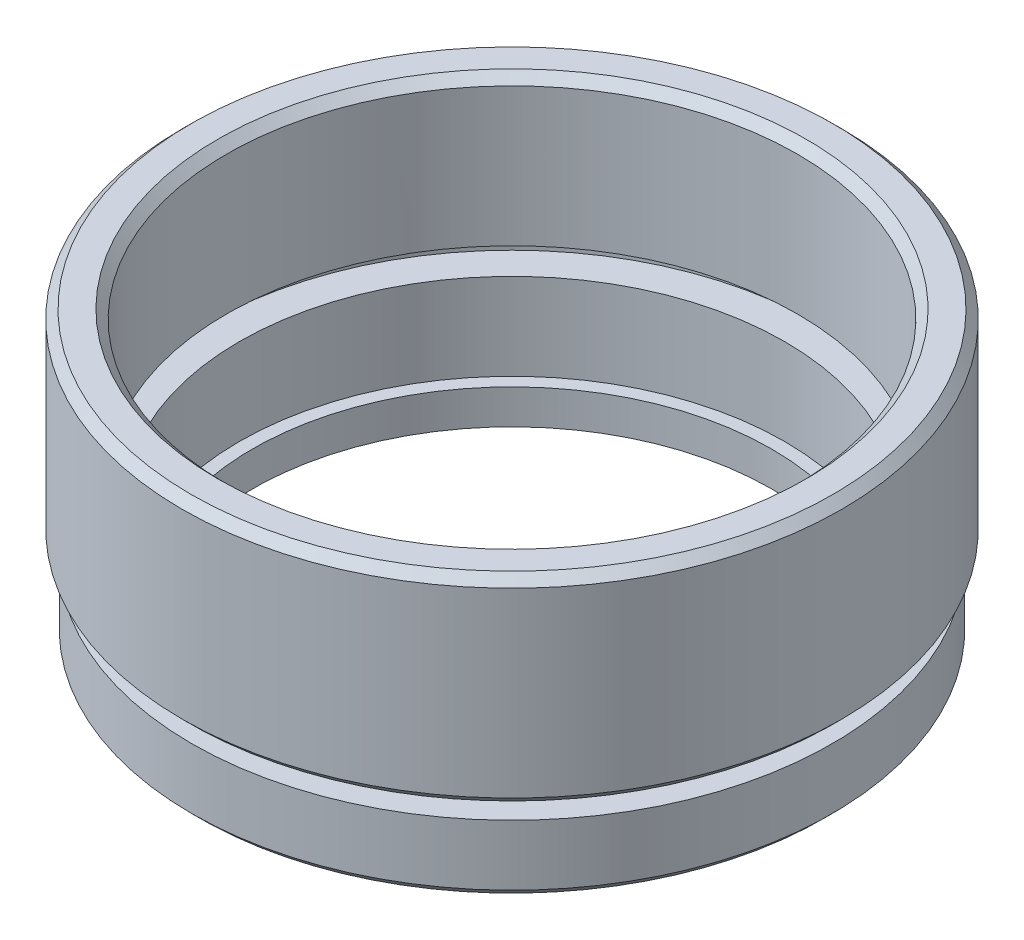
ISO-10303-21;
HEADER;
FILE_DESCRIPTION(('STEP AP214'),'2;1');
FILE_NAME('part.step','',(''),(''),'','','');
FILE_SCHEMA(('AUTOMOTIVE_DESIGN { 1 0 10303 214 1 1 1 1 }'));
ENDSEC;
DATA;
#1=APPLICATION_CONTEXT('core data for automotive mechanical design processes');
#2=APPLICATION_PROTOCOL_DEFINITION('international standard','automotive_design',2000,#1);
#3=PRODUCT_CONTEXT('',#1,'mechanical');
#4=PRODUCT('Part','Part','',(#3));
#5=PRODUCT_RELATED_PRODUCT_CATEGORY('part','',(#4));
#6=PRODUCT_DEFINITION_FORMATION('','',#4);
#7=PRODUCT_DEFINITION_CONTEXT('part definition',#1,'design');
#8=PRODUCT_DEFINITION('design','',#6,#7);
#9=PRODUCT_DEFINITION_SHAPE('','',#8);
#10=(LENGTH_UNIT() NAMED_UNIT(*) SI_UNIT(.MILLI.,.METRE.));
#11=(NAMED_UNIT(*) PLANE_ANGLE_UNIT() SI_UNIT($,.RADIAN.));
#12=(NAMED_UNIT(*) SI_UNIT($,.STERADIAN.) SOLID_ANGLE_UNIT());
#13=UNCERTAINTY_MEASURE_WITH_UNIT(LENGTH_MEASURE(1.E-05),#10,'distance_accuracy_value','');
#14=(GEOMETRIC_REPRESENTATION_CONTEXT(3) GLOBAL_UNCERTAINTY_ASSIGNED_CONTEXT((#13)) GLOBAL_UNIT_ASSIGNED_CONTEXT((#10,
#11,#12)) REPRESENTATION_CONTEXT('',''));
#15=CARTESIAN_POINT('',(0.,0.,0.));
#16=DIRECTION('',(0.,0.,1.));
#17=DIRECTION('',(1.,0.,0.));
#18=AXIS2_PLACEMENT_3D('',#15,#16,#17);
#19=CARTESIAN_POINT('',(0.,0.,0.));
#20=DIRECTION('',(0.,-1.,0.));
#21=DIRECTION('',(0.,0.,-1.));
#22=AXIS2_PLACEMENT_3D('',#19,#20,#21);
#23=CYLINDRICAL_SURFACE('',#22,15.);
#24=CARTESIAN_POINT('',(0.,0.,0.));
#25=DIRECTION('',(0.,-1.,0.));
#26=DIRECTION('',(0.,0.,-1.));
#27=AXIS2_PLACEMENT_3D('',#24,#25,#26);
#28=CIRCLE('',#27,15.);
#29=CARTESIAN_POINT('',(0.,0.,-15.));
#30=VERTEX_POINT('',#29);
#31=EDGE_CURVE('E82',#30,#30,#28,.T.);
#32=ORIENTED_EDGE('',*,*,#31,.T.);
#33=EDGE_LOOP('',(#32));
#34=FACE_BOUND('',#33,.T.);
#35=CARTESIAN_POINT('',(0.,2.,0.));
#36=DIRECTION('',(0.,-1.,0.));
#37=DIRECTION('',(0.,0.,-1.));
#38=AXIS2_PLACEMENT_3D('',#35,#36,#37);
#39=CIRCLE('',#38,15.);
#40=CARTESIAN_POINT('',(0.,2.,-15.));
#41=VERTEX_POINT('',#40);
#42=EDGE_CURVE('E115',#41,#41,#39,.T.);
#43=ORIENTED_EDGE('',*,*,#42,.F.);
#44=EDGE_LOOP('',(#43));
#45=FACE_BOUND('',#44,.T.);
#46=ADVANCED_FACE('F39',(#34,#45),#23,.F.);
#47=CARTESIAN_POINT('',(15.,0.,0.));
#48=DIRECTION('',(0.,-1.,0.));
#49=DIRECTION('',(0.,0.,-1.));
#50=AXIS2_PLACEMENT_3D('',#47,#48,#49);
#51=PLANE('',#50);
#52=CARTESIAN_POINT('',(0.,0.,0.));
#53=DIRECTION('',(0.,-1.,0.));
#54=DIRECTION('',(0.,0.,-1.));
#55=AXIS2_PLACEMENT_3D('',#52,#53,#54);
#56=CIRCLE('',#55,18.);
#57=CARTESIAN_POINT('',(0.,0.,-18.));
#58=VERTEX_POINT('',#57);
#59=EDGE_CURVE('E47',#58,#58,#56,.T.);
#60=ORIENTED_EDGE('',*,*,#59,.T.);
#61=EDGE_LOOP('',(#60));
#62=FACE_BOUND('',#61,.T.);
#63=ORIENTED_EDGE('',*,*,#31,.F.);
#64=EDGE_LOOP('',(#63));
#65=FACE_BOUND('',#64,.T.);
#66=ADVANCED_FACE('F124',(#62,#65),#51,.T.);
#67=CARTESIAN_POINT('',(0.,0.,0.));
#68=DIRECTION('',(0.,-1.,0.));
#69=DIRECTION('',(0.,0.,-1.));
#70=AXIS2_PLACEMENT_3D('',#67,#68,#69);
#71=CYLINDRICAL_SURFACE('',#70,18.5);
#72=CARTESIAN_POINT('',(0.,0.500000000000004,0.));
#73=DIRECTION('',(0.,-1.,0.));
#74=DIRECTION('',(0.,0.,-1.));
#75=AXIS2_PLACEMENT_3D('',#72,#73,#74);
#76=CIRCLE('',#75,18.5);
#77=CARTESIAN_POINT('',(0.,0.500000000000004,-18.5));
#78=VERTEX_POINT('',#77);
#79=EDGE_CURVE('E10',#78,#78,#76,.F.);
#80=ORIENTED_EDGE('',*,*,#79,.T.);
#81=EDGE_LOOP('',(#80));
#82=FACE_BOUND('',#81,.T.);
#83=CARTESIAN_POINT('',(0.,4.,0.));
#84=DIRECTION('',(0.,-1.,0.));
#85=DIRECTION('',(0.,0.,-1.));
#86=AXIS2_PLACEMENT_3D('',#83,#84,#85);
#87=CIRCLE('',#86,18.5);
#88=CARTESIAN_POINT('',(0.,4.,-18.5));
#89=VERTEX_POINT('',#88);
#90=EDGE_CURVE('E85',#89,#89,#87,.T.);
#91=ORIENTED_EDGE('',*,*,#90,.T.);
#92=EDGE_LOOP('',(#91));
#93=FACE_BOUND('',#92,.T.);
#94=ADVANCED_FACE('F130',(#82,#93),#71,.T.);
#95=CARTESIAN_POINT('',(18.5,4.,0.));
#96=DIRECTION('',(0.,1.,0.));
#97=DIRECTION('',(0.,0.,1.));
#98=AXIS2_PLACEMENT_3D('',#95,#96,#97);
#99=PLANE('',#98);
#100=CARTESIAN_POINT('',(0.,4.,0.));
#101=DIRECTION('',(0.,-1.,0.));
#102=DIRECTION('',(0.,0.,-1.));
#103=AXIS2_PLACEMENT_3D('',#100,#101,#102);
#104=CIRCLE('',#103,17.);
#105=CARTESIAN_POINT('',(0.,4.,-17.));
#106=VERTEX_POINT('',#105);
#107=EDGE_CURVE('E89',#106,#106,#104,.T.);
#108=ORIENTED_EDGE('',*,*,#107,.T.);
#109=EDGE_LOOP('',(#108));
#110=FACE_BOUND('',#109,.T.);
#111=ORIENTED_EDGE('',*,*,#90,.F.);
#112=EDGE_LOOP('',(#111));
#113=FACE_BOUND('',#112,.T.);
#114=ADVANCED_FACE('F162',(#110,#113),#99,.T.);
#115=CARTESIAN_POINT('',(0.,0.,0.));
#116=DIRECTION('',(0.,-1.,0.));
#117=DIRECTION('',(0.,0.,-1.));
#118=AXIS2_PLACEMENT_3D('',#115,#116,#117);
#119=CYLINDRICAL_SURFACE('',#118,17.);
#120=CARTESIAN_POINT('',(0.,5.,0.));
#121=DIRECTION('',(0.,-1.,0.));
#122=DIRECTION('',(0.,0.,-1.));
#123=AXIS2_PLACEMENT_3D('',#120,#121,#122);
#124=CIRCLE('',#123,17.);
#125=CARTESIAN_POINT('',(0.,5.,-17.));
#126=VERTEX_POINT('',#125);
#127=EDGE_CURVE('E93',#126,#126,#124,.T.);
#128=ORIENTED_EDGE('',*,*,#127,.T.);
#129=EDGE_LOOP('',(#128));
#130=FACE_BOUND('',#129,.T.);
#131=ORIENTED_EDGE('',*,*,#107,.F.);
#132=EDGE_LOOP('',(#131));
#133=FACE_BOUND('',#132,.T.);
#134=ADVANCED_FACE('F156',(#130,#133),#119,.T.);
#135=CARTESIAN_POINT('',(17.,5.,0.));
#136=DIRECTION('',(0.,-1.,0.));
#137=DIRECTION('',(0.,0.,-1.));
#138=AXIS2_PLACEMENT_3D('',#135,#136,#137);
#139=PLANE('',#138);
#140=CARTESIAN_POINT('',(0.,5.,0.));
#141=DIRECTION('',(0.,-1.,0.));
#142=DIRECTION('',(0.,0.,-1.));
#143=AXIS2_PLACEMENT_3D('',#140,#141,#142);
#144=CIRCLE('',#143,18.55);
#145=CARTESIAN_POINT('',(0.,5.,-18.55));
#146=VERTEX_POINT('',#145);
#147=EDGE_CURVE('E53',#146,#146,#144,.T.);
#148=ORIENTED_EDGE('',*,*,#147,.T.);
#149=EDGE_LOOP('',(#148));
#150=FACE_BOUND('',#149,.T.);
#151=ORIENTED_EDGE('',*,*,#127,.F.);
#152=EDGE_LOOP('',(#151));
#153=FACE_BOUND('',#152,.T.);
#154=ADVANCED_FACE('F152',(#150,#153),#139,.T.);
#155=CARTESIAN_POINT('',(0.,0.,0.));
#156=DIRECTION('',(0.,-1.,0.));
#157=DIRECTION('',(0.,0.,-1.));
#158=AXIS2_PLACEMENT_3D('',#155,#156,#157);
#159=CYLINDRICAL_SURFACE('',#158,19.05);
#160=CARTESIAN_POINT('',(0.,16.,0.));
#161=DIRECTION('',(0.,1.,0.));
#162=DIRECTION('',(0.,0.,1.));
#163=AXIS2_PLACEMENT_3D('',#160,#161,#162);
#164=CIRCLE('',#163,19.05);
#165=CARTESIAN_POINT('',(0.,16.,19.05));
#166=VERTEX_POINT('',#165);
#167=EDGE_CURVE('E60',#166,#166,#164,.F.);
#168=ORIENTED_EDGE('',*,*,#167,.T.);
#169=EDGE_LOOP('',(#168));
#170=FACE_BOUND('',#169,.T.);
#171=CARTESIAN_POINT('',(0.,5.50000000000001,0.));
#172=DIRECTION('',(0.,-1.,0.));
#173=DIRECTION('',(0.,0.,-1.));
#174=AXIS2_PLACEMENT_3D('',#171,#172,#173);
#175=CIRCLE('',#174,19.05);
#176=CARTESIAN_POINT('',(0.,5.50000000000001,-19.05));
#177=VERTEX_POINT('',#176);
#178=EDGE_CURVE('E66',#177,#177,#175,.F.);
#179=ORIENTED_EDGE('',*,*,#178,.T.);
#180=EDGE_LOOP('',(#179));
#181=FACE_BOUND('',#180,.T.);
#182=ADVANCED_FACE('F155',(#170,#181),#159,.T.);
#183=CARTESIAN_POINT('',(19.05,16.5,0.));
#184=DIRECTION('',(0.,1.,0.));
#185=DIRECTION('',(0.,0.,1.));
#186=AXIS2_PLACEMENT_3D('',#183,#184,#185);
#187=PLANE('',#186);
#188=CARTESIAN_POINT('',(0.,16.5,0.));
#189=DIRECTION('',(0.,1.,0.));
#190=DIRECTION('',(0.,0.,1.));
#191=AXIS2_PLACEMENT_3D('',#188,#189,#190);
#192=CIRCLE('',#191,17.);
#193=CARTESIAN_POINT('',(0.,16.5,17.));
#194=VERTEX_POINT('',#193);
#195=EDGE_CURVE('E74',#194,#194,#192,.F.);
#196=ORIENTED_EDGE('',*,*,#195,.T.);
#197=EDGE_LOOP('',(#196));
#198=FACE_BOUND('',#197,.T.);
#199=CARTESIAN_POINT('',(0.,16.5,0.));
#200=DIRECTION('',(0.,1.,0.));
#201=DIRECTION('',(0.,0.,1.));
#202=AXIS2_PLACEMENT_3D('',#199,#200,#201);
#203=CIRCLE('',#202,18.55);
#204=CARTESIAN_POINT('',(0.,16.5,18.55));
#205=VERTEX_POINT('',#204);
#206=EDGE_CURVE('E78',#205,#205,#203,.T.);
#207=ORIENTED_EDGE('',*,*,#206,.T.);
#208=EDGE_LOOP('',(#207));
#209=FACE_BOUND('',#208,.T.);
#210=ADVANCED_FACE('F177',(#198,#209),#187,.T.);
#211=CARTESIAN_POINT('',(0.,0.,0.));
#212=DIRECTION('',(0.,-1.,0.));
#213=DIRECTION('',(0.,0.,-1.));
#214=AXIS2_PLACEMENT_3D('',#211,#212,#213);
#215=CYLINDRICAL_SURFACE('',#214,16.5);
#216=CARTESIAN_POINT('',(0.,16.,0.));
#217=DIRECTION('',(0.,1.,0.));
#218=DIRECTION('',(0.,0.,1.));
#219=AXIS2_PLACEMENT_3D('',#216,#217,#218);
#220=CIRCLE('',#219,16.5);
#221=CARTESIAN_POINT('',(0.,16.,16.5));
#222=VERTEX_POINT('',#221);
#223=EDGE_CURVE('E70',#222,#222,#220,.T.);
#224=ORIENTED_EDGE('',*,*,#223,.T.);
#225=EDGE_LOOP('',(#224));
#226=FACE_BOUND('',#225,.T.);
#227=CARTESIAN_POINT('',(0.,8.,0.));
#228=DIRECTION('',(0.,-1.,0.));
#229=DIRECTION('',(0.,0.,-1.));
#230=AXIS2_PLACEMENT_3D('',#227,#228,#229);
#231=CIRCLE('',#230,16.5);
#232=CARTESIAN_POINT('',(0.,8.,-16.5));
#233=VERTEX_POINT('',#232);
#234=EDGE_CURVE('E97',#233,#233,#231,.T.);
#235=ORIENTED_EDGE('',*,*,#234,.T.);
#236=EDGE_LOOP('',(#235));
#237=FACE_BOUND('',#236,.T.);
#238=ADVANCED_FACE('F181',(#226,#237),#215,.F.);
#239=CARTESIAN_POINT('',(16.5,8.,0.));
#240=DIRECTION('',(0.,-1.,0.));
#241=DIRECTION('',(0.,0.,-1.));
#242=AXIS2_PLACEMENT_3D('',#239,#240,#241);
#243=PLANE('',#242);
#244=CARTESIAN_POINT('',(0.,8.,0.));
#245=DIRECTION('',(0.,-1.,0.));
#246=DIRECTION('',(0.,0.,-1.));
#247=AXIS2_PLACEMENT_3D('',#244,#245,#246);
#248=CIRCLE('',#247,17.6);
#249=CARTESIAN_POINT('',(0.,8.,-17.6));
#250=VERTEX_POINT('',#249);
#251=EDGE_CURVE('E101',#250,#250,#248,.T.);
#252=ORIENTED_EDGE('',*,*,#251,.T.);
#253=EDGE_LOOP('',(#252));
#254=FACE_BOUND('',#253,.T.);
#255=ORIENTED_EDGE('',*,*,#234,.F.);
#256=EDGE_LOOP('',(#255));
#257=FACE_BOUND('',#256,.T.);
#258=ADVANCED_FACE('F185',(#254,#257),#243,.T.);
#259=CARTESIAN_POINT('',(0.,0.,0.));
#260=DIRECTION('',(0.,-1.,0.));
#261=DIRECTION('',(0.,0.,-1.));
#262=AXIS2_PLACEMENT_3D('',#259,#260,#261);
#263=CYLINDRICAL_SURFACE('',#262,17.6);
#264=CARTESIAN_POINT('',(0.,7.,0.));
#265=DIRECTION('',(0.,-1.,0.));
#266=DIRECTION('',(0.,0.,-1.));
#267=AXIS2_PLACEMENT_3D('',#264,#265,#266);
#268=CIRCLE('',#267,17.6);
#269=CARTESIAN_POINT('',(0.,7.,-17.6));
#270=VERTEX_POINT('',#269);
#271=EDGE_CURVE('E104',#270,#270,#268,.T.);
#272=ORIENTED_EDGE('',*,*,#271,.T.);
#273=EDGE_LOOP('',(#272));
#274=FACE_BOUND('',#273,.T.);
#275=ORIENTED_EDGE('',*,*,#251,.F.);
#276=EDGE_LOOP('',(#275));
#277=FACE_BOUND('',#276,.T.);
#278=ADVANCED_FACE('F189',(#274,#277),#263,.F.);
#279=CARTESIAN_POINT('',(17.6,7.,0.));
#280=DIRECTION('',(0.,1.,0.));
#281=DIRECTION('',(0.,0.,1.));
#282=AXIS2_PLACEMENT_3D('',#279,#280,#281);
#283=PLANE('',#282);
#284=CARTESIAN_POINT('',(0.,7.,0.));
#285=DIRECTION('',(0.,-1.,0.));
#286=DIRECTION('',(0.,0.,-1.));
#287=AXIS2_PLACEMENT_3D('',#284,#285,#286);
#288=CIRCLE('',#287,15.75);
#289=CARTESIAN_POINT('',(0.,7.,-15.75));
#290=VERTEX_POINT('',#289);
#291=EDGE_CURVE('E108',#290,#290,#288,.T.);
#292=ORIENTED_EDGE('',*,*,#291,.T.);
#293=EDGE_LOOP('',(#292));
#294=FACE_BOUND('',#293,.T.);
#295=ORIENTED_EDGE('',*,*,#271,.F.);
#296=EDGE_LOOP('',(#295));
#297=FACE_BOUND('',#296,.T.);
#298=ADVANCED_FACE('F193',(#294,#297),#283,.T.);
#299=CARTESIAN_POINT('',(0.,0.,0.));
#300=DIRECTION('',(0.,-1.,0.));
#301=DIRECTION('',(0.,0.,-1.));
#302=AXIS2_PLACEMENT_3D('',#299,#300,#301);
#303=CYLINDRICAL_SURFACE('',#302,15.75);
#304=CARTESIAN_POINT('',(0.,2.,0.));
#305=DIRECTION('',(0.,-1.,0.));
#306=DIRECTION('',(0.,0.,-1.));
#307=AXIS2_PLACEMENT_3D('',#304,#305,#306);
#308=CIRCLE('',#307,15.75);
#309=CARTESIAN_POINT('',(0.,2.,-15.75));
#310=VERTEX_POINT('',#309);
#311=EDGE_CURVE('E111',#310,#310,#308,.T.);
#312=ORIENTED_EDGE('',*,*,#311,.T.);
#313=EDGE_LOOP('',(#312));
#314=FACE_BOUND('',#313,.T.);
#315=ORIENTED_EDGE('',*,*,#291,.F.);
#316=EDGE_LOOP('',(#315));
#317=FACE_BOUND('',#316,.T.);
#318=ADVANCED_FACE('F197',(#314,#317),#303,.F.);
#319=CARTESIAN_POINT('',(15.75,2.,0.));
#320=DIRECTION('',(0.,1.,0.));
#321=DIRECTION('',(0.,0.,1.));
#322=AXIS2_PLACEMENT_3D('',#319,#320,#321);
#323=PLANE('',#322);
#324=ORIENTED_EDGE('',*,*,#42,.T.);
#325=EDGE_LOOP('',(#324));
#326=FACE_BOUND('',#325,.T.);
#327=ORIENTED_EDGE('',*,*,#311,.F.);
#328=EDGE_LOOP('',(#327));
#329=FACE_BOUND('',#328,.T.);
#330=ADVANCED_FACE('F120',(#326,#329),#323,.T.);
#331=CARTESIAN_POINT('',(0.,16.5,0.));
#332=DIRECTION('',(0.,1.,0.));
#333=DIRECTION('',(0.,0.,1.));
#334=AXIS2_PLACEMENT_3D('',#331,#332,#333);
#335=CONICAL_SURFACE('',#334,17.,0.785398163397448);
#336=ORIENTED_EDGE('',*,*,#223,.F.);
#337=EDGE_LOOP('',(#336));
#338=FACE_BOUND('',#337,.T.);
#339=ORIENTED_EDGE('',*,*,#195,.F.);
#340=EDGE_LOOP('',(#339));
#341=FACE_BOUND('',#340,.T.);
#342=ADVANCED_FACE('F134',(#338,#341),#335,.F.);
#343=CARTESIAN_POINT('',(0.,16.,0.));
#344=DIRECTION('',(0.,-1.,0.));
#345=DIRECTION('',(0.,0.,-1.));
#346=AXIS2_PLACEMENT_3D('',#343,#344,#345);
#347=CONICAL_SURFACE('',#346,19.05,0.785398163397448);
#348=ORIENTED_EDGE('',*,*,#206,.F.);
#349=EDGE_LOOP('',(#348));
#350=FACE_BOUND('',#349,.T.);
#351=ORIENTED_EDGE('',*,*,#167,.F.);
#352=EDGE_LOOP('',(#351));
#353=FACE_BOUND('',#352,.T.);
#354=ADVANCED_FACE('F137',(#350,#353),#347,.T.);
#355=CARTESIAN_POINT('',(0.,5.,0.));
#356=DIRECTION('',(0.,1.,0.));
#357=DIRECTION('',(0.,0.,1.));
#358=AXIS2_PLACEMENT_3D('',#355,#356,#357);
#359=CONICAL_SURFACE('',#358,18.55,0.785398163397441);
#360=ORIENTED_EDGE('',*,*,#178,.F.);
#361=EDGE_LOOP('',(#360));
#362=FACE_BOUND('',#361,.T.);
#363=ORIENTED_EDGE('',*,*,#147,.F.);
#364=EDGE_LOOP('',(#363));
#365=FACE_BOUND('',#364,.T.);
#366=ADVANCED_FACE('F140',(#362,#365),#359,.T.);
#367=CARTESIAN_POINT('',(0.,0.,0.));
#368=DIRECTION('',(0.,1.,0.));
#369=DIRECTION('',(0.,0.,1.));
#370=AXIS2_PLACEMENT_3D('',#367,#368,#369);
#371=CONICAL_SURFACE('',#370,18.,0.785398163397445);
#372=ORIENTED_EDGE('',*,*,#79,.F.);
#373=EDGE_LOOP('',(#372));
#374=FACE_BOUND('',#373,.T.);
#375=ORIENTED_EDGE('',*,*,#59,.F.);
#376=EDGE_LOOP('',(#375));
#377=FACE_BOUND('',#376,.T.);
#378=ADVANCED_FACE('F41',(#374,#377),#371,.T.);
#379=CLOSED_SHELL('',(#46,#66,#94,#114,#134,#154,#182,#210,#238,#258,#278,#298,#318,#330,#342,
#354,#366,#378));
#380=MANIFOLD_SOLID_BREP('B2',#379);
#381=ADVANCED_BREP_SHAPE_REPRESENTATION('',(#18,#380),#14);
#382=SHAPE_DEFINITION_REPRESENTATION(#9,#381);
ENDSEC;
END-ISO-10303-21;
